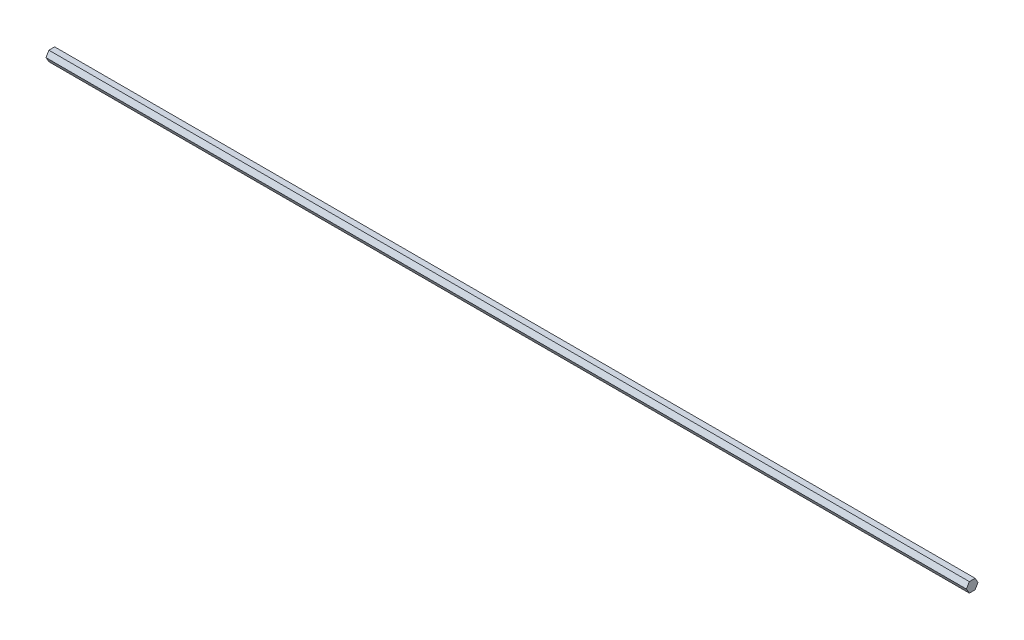
ISO-10303-21;
HEADER;
FILE_DESCRIPTION(('STEP AP214'),'2;1');
FILE_NAME('part.step','',(''),(''),'','','');
FILE_SCHEMA(('AUTOMOTIVE_DESIGN { 1 0 10303 214 1 1 1 1 }'));
ENDSEC;
DATA;
#1=APPLICATION_CONTEXT('core data for automotive mechanical design processes');
#2=APPLICATION_PROTOCOL_DEFINITION('international standard','automotive_design',2000,#1);
#3=PRODUCT_CONTEXT('',#1,'mechanical');
#4=PRODUCT('Part','Part','',(#3));
#5=PRODUCT_RELATED_PRODUCT_CATEGORY('part','',(#4));
#6=PRODUCT_DEFINITION_FORMATION('','',#4);
#7=PRODUCT_DEFINITION_CONTEXT('part definition',#1,'design');
#8=PRODUCT_DEFINITION('design','',#6,#7);
#9=PRODUCT_DEFINITION_SHAPE('','',#8);
#10=(LENGTH_UNIT() NAMED_UNIT(*) SI_UNIT(.MILLI.,.METRE.));
#11=(NAMED_UNIT(*) PLANE_ANGLE_UNIT() SI_UNIT($,.RADIAN.));
#12=(NAMED_UNIT(*) SI_UNIT($,.STERADIAN.) SOLID_ANGLE_UNIT());
#13=UNCERTAINTY_MEASURE_WITH_UNIT(LENGTH_MEASURE(1.E-05),#10,'distance_accuracy_value','');
#14=(GEOMETRIC_REPRESENTATION_CONTEXT(3) GLOBAL_UNCERTAINTY_ASSIGNED_CONTEXT((#13)) GLOBAL_UNIT_ASSIGNED_CONTEXT((#10,
#11,#12)) REPRESENTATION_CONTEXT('',''));
#15=CARTESIAN_POINT('',(0.,0.,0.));
#16=DIRECTION('',(0.,0.,1.));
#17=DIRECTION('',(1.,0.,0.));
#18=AXIS2_PLACEMENT_3D('',#15,#16,#17);
#19=CARTESIAN_POINT('',(119.38,-1.29903810567666,-0.75));
#20=DIRECTION('',(0.,0.5,0.866025403784439));
#21=DIRECTION('',(0.,-0.866025403784439,0.5));
#22=AXIS2_PLACEMENT_3D('',#19,#20,#21);
#23=PLANE('',#22);
#24=DIRECTION('',(0.,0.866025403784439,-0.5));
#25=VECTOR('',#24,1.);
#26=CARTESIAN_POINT('',(-119.38,-1.29903810567666,-0.75));
#27=LINE('',#26,#25);
#28=CARTESIAN_POINT('',(-119.38,-1.29903810567666,-0.75));
#29=VERTEX_POINT('',#28);
#30=CARTESIAN_POINT('',(-119.38,0.,-1.5));
#31=VERTEX_POINT('',#30);
#32=EDGE_CURVE('E116',#29,#31,#27,.T.);
#33=ORIENTED_EDGE('',*,*,#32,.T.);
#34=DIRECTION('',(-1.,0.,0.));
#35=VECTOR('',#34,1.);
#36=CARTESIAN_POINT('',(119.38,0.,-1.5));
#37=LINE('',#36,#35);
#38=CARTESIAN_POINT('',(119.38,0.,-1.5));
#39=VERTEX_POINT('',#38);
#40=EDGE_CURVE('E11',#39,#31,#37,.T.);
#41=ORIENTED_EDGE('',*,*,#40,.F.);
#42=DIRECTION('',(0.,0.866025403784439,-0.5));
#43=VECTOR('',#42,1.);
#44=CARTESIAN_POINT('',(119.38,-1.29903810567666,-0.75));
#45=LINE('',#44,#43);
#46=CARTESIAN_POINT('',(119.38,-1.29903810567666,-0.75));
#47=VERTEX_POINT('',#46);
#48=EDGE_CURVE('E126',#47,#39,#45,.T.);
#49=ORIENTED_EDGE('',*,*,#48,.F.);
#50=DIRECTION('',(-1.,0.,0.));
#51=VECTOR('',#50,1.);
#52=CARTESIAN_POINT('',(119.38,-1.29903810567666,-0.75));
#53=LINE('',#52,#51);
#54=EDGE_CURVE('E112',#47,#29,#53,.T.);
#55=ORIENTED_EDGE('',*,*,#54,.T.);
#56=EDGE_LOOP('',(#33,#41,#49,#55));
#57=FACE_BOUND('',#56,.T.);
#58=ADVANCED_FACE('F32',(#57),#23,.F.);
#59=CARTESIAN_POINT('',(119.38,0.,-1.5));
#60=DIRECTION('',(0.,-0.5,0.866025403784439));
#61=DIRECTION('',(0.,-0.866025403784439,-0.5));
#62=AXIS2_PLACEMENT_3D('',#59,#60,#61);
#63=PLANE('',#62);
#64=DIRECTION('',(0.,0.866025403784439,0.5));
#65=VECTOR('',#64,1.);
#66=CARTESIAN_POINT('',(-119.38,0.,-1.5));
#67=LINE('',#66,#65);
#68=CARTESIAN_POINT('',(-119.38,1.29903810567666,-0.75));
#69=VERTEX_POINT('',#68);
#70=EDGE_CURVE('E119',#31,#69,#67,.T.);
#71=ORIENTED_EDGE('',*,*,#70,.T.);
#72=DIRECTION('',(-1.,0.,0.));
#73=VECTOR('',#72,1.);
#74=CARTESIAN_POINT('',(119.38,1.29903810567666,-0.75));
#75=LINE('',#74,#73);
#76=CARTESIAN_POINT('',(119.38,1.29903810567666,-0.75));
#77=VERTEX_POINT('',#76);
#78=EDGE_CURVE('E40',#77,#69,#75,.T.);
#79=ORIENTED_EDGE('',*,*,#78,.F.);
#80=DIRECTION('',(0.,0.866025403784439,0.5));
#81=VECTOR('',#80,1.);
#82=CARTESIAN_POINT('',(119.38,0.,-1.5));
#83=LINE('',#82,#81);
#84=EDGE_CURVE('E85',#39,#77,#83,.T.);
#85=ORIENTED_EDGE('',*,*,#84,.F.);
#86=ORIENTED_EDGE('',*,*,#40,.T.);
#87=EDGE_LOOP('',(#71,#79,#85,#86));
#88=FACE_BOUND('',#87,.T.);
#89=ADVANCED_FACE('F150',(#88),#63,.F.);
#90=CARTESIAN_POINT('',(119.38,1.29903810567666,-0.75));
#91=DIRECTION('',(0.,-1.,0.));
#92=DIRECTION('',(0.,0.,-1.));
#93=AXIS2_PLACEMENT_3D('',#90,#91,#92);
#94=PLANE('',#93);
#95=DIRECTION('',(0.,0.,1.));
#96=VECTOR('',#95,1.);
#97=CARTESIAN_POINT('',(-119.38,1.29903810567666,-0.75));
#98=LINE('',#97,#96);
#99=CARTESIAN_POINT('',(-119.38,1.29903810567666,0.75));
#100=VERTEX_POINT('',#99);
#101=EDGE_CURVE('E121',#69,#100,#98,.T.);
#102=ORIENTED_EDGE('',*,*,#101,.T.);
#103=DIRECTION('',(-1.,0.,0.));
#104=VECTOR('',#103,1.);
#105=CARTESIAN_POINT('',(119.38,1.29903810567666,0.75));
#106=LINE('',#105,#104);
#107=CARTESIAN_POINT('',(119.38,1.29903810567666,0.75));
#108=VERTEX_POINT('',#107);
#109=EDGE_CURVE('E107',#108,#100,#106,.T.);
#110=ORIENTED_EDGE('',*,*,#109,.F.);
#111=DIRECTION('',(0.,0.,1.));
#112=VECTOR('',#111,1.);
#113=CARTESIAN_POINT('',(119.38,1.29903810567666,-0.75));
#114=LINE('',#113,#112);
#115=EDGE_CURVE('E98',#77,#108,#114,.T.);
#116=ORIENTED_EDGE('',*,*,#115,.F.);
#117=ORIENTED_EDGE('',*,*,#78,.T.);
#118=EDGE_LOOP('',(#102,#110,#116,#117));
#119=FACE_BOUND('',#118,.T.);
#120=ADVANCED_FACE('F132',(#119),#94,.F.);
#121=CARTESIAN_POINT('',(119.38,1.29903810567666,0.75));
#122=DIRECTION('',(0.,-0.5,-0.866025403784439));
#123=DIRECTION('',(0.,0.866025403784439,-0.5));
#124=AXIS2_PLACEMENT_3D('',#121,#122,#123);
#125=PLANE('',#124);
#126=DIRECTION('',(0.,-0.866025403784439,0.5));
#127=VECTOR('',#126,1.);
#128=CARTESIAN_POINT('',(-119.38,1.29903810567666,0.75));
#129=LINE('',#128,#127);
#130=CARTESIAN_POINT('',(-119.38,0.,1.5));
#131=VERTEX_POINT('',#130);
#132=EDGE_CURVE('E106',#100,#131,#129,.T.);
#133=ORIENTED_EDGE('',*,*,#132,.T.);
#134=DIRECTION('',(-1.,0.,0.));
#135=VECTOR('',#134,1.);
#136=CARTESIAN_POINT('',(119.38,0.,1.5));
#137=LINE('',#136,#135);
#138=CARTESIAN_POINT('',(119.38,0.,1.5));
#139=VERTEX_POINT('',#138);
#140=EDGE_CURVE('E103',#139,#131,#137,.T.);
#141=ORIENTED_EDGE('',*,*,#140,.F.);
#142=DIRECTION('',(0.,-0.866025403784439,0.5));
#143=VECTOR('',#142,1.);
#144=CARTESIAN_POINT('',(119.38,1.29903810567666,0.75));
#145=LINE('',#144,#143);
#146=EDGE_CURVE('E92',#108,#139,#145,.T.);
#147=ORIENTED_EDGE('',*,*,#146,.F.);
#148=ORIENTED_EDGE('',*,*,#109,.T.);
#149=EDGE_LOOP('',(#133,#141,#147,#148));
#150=FACE_BOUND('',#149,.T.);
#151=ADVANCED_FACE('F104',(#150),#125,.F.);
#152=CARTESIAN_POINT('',(119.38,0.,1.5));
#153=DIRECTION('',(0.,0.5,-0.866025403784438));
#154=DIRECTION('',(0.,0.866025403784438,0.5));
#155=AXIS2_PLACEMENT_3D('',#152,#153,#154);
#156=PLANE('',#155);
#157=DIRECTION('',(0.,-0.866025403784439,-0.5));
#158=VECTOR('',#157,1.);
#159=CARTESIAN_POINT('',(-119.38,0.,1.5));
#160=LINE('',#159,#158);
#161=CARTESIAN_POINT('',(-119.38,-1.29903810567666,0.75));
#162=VERTEX_POINT('',#161);
#163=EDGE_CURVE('E71',#131,#162,#160,.T.);
#164=ORIENTED_EDGE('',*,*,#163,.T.);
#165=DIRECTION('',(-1.,0.,0.));
#166=VECTOR('',#165,1.);
#167=CARTESIAN_POINT('',(119.38,-1.29903810567666,0.75));
#168=LINE('',#167,#166);
#169=CARTESIAN_POINT('',(119.38,-1.29903810567666,0.75));
#170=VERTEX_POINT('',#169);
#171=EDGE_CURVE('E108',#170,#162,#168,.T.);
#172=ORIENTED_EDGE('',*,*,#171,.F.);
#173=DIRECTION('',(0.,-0.866025403784439,-0.5));
#174=VECTOR('',#173,1.);
#175=CARTESIAN_POINT('',(119.38,0.,1.5));
#176=LINE('',#175,#174);
#177=EDGE_CURVE('E96',#139,#170,#176,.T.);
#178=ORIENTED_EDGE('',*,*,#177,.F.);
#179=ORIENTED_EDGE('',*,*,#140,.T.);
#180=EDGE_LOOP('',(#164,#172,#178,#179));
#181=FACE_BOUND('',#180,.T.);
#182=ADVANCED_FACE('F110',(#181),#156,.F.);
#183=CARTESIAN_POINT('',(119.38,-1.29903810567666,0.75));
#184=DIRECTION('',(0.,1.,0.));
#185=DIRECTION('',(0.,0.,1.));
#186=AXIS2_PLACEMENT_3D('',#183,#184,#185);
#187=PLANE('',#186);
#188=DIRECTION('',(0.,0.,-1.));
#189=VECTOR('',#188,1.);
#190=CARTESIAN_POINT('',(-119.38,-1.29903810567666,0.75));
#191=LINE('',#190,#189);
#192=EDGE_CURVE('E77',#162,#29,#191,.T.);
#193=ORIENTED_EDGE('',*,*,#192,.T.);
#194=ORIENTED_EDGE('',*,*,#54,.F.);
#195=DIRECTION('',(0.,0.,-1.));
#196=VECTOR('',#195,1.);
#197=CARTESIAN_POINT('',(119.38,-1.29903810567666,0.75));
#198=LINE('',#197,#196);
#199=EDGE_CURVE('E48',#170,#47,#198,.T.);
#200=ORIENTED_EDGE('',*,*,#199,.F.);
#201=ORIENTED_EDGE('',*,*,#171,.T.);
#202=EDGE_LOOP('',(#193,#194,#200,#201));
#203=FACE_BOUND('',#202,.T.);
#204=ADVANCED_FACE('F139',(#203),#187,.F.);
#205=CARTESIAN_POINT('',(119.38,0.,0.));
#206=DIRECTION('',(1.,0.,0.));
#207=DIRECTION('',(0.,0.,-1.));
#208=AXIS2_PLACEMENT_3D('',#205,#206,#207);
#209=PLANE('',#208);
#210=ORIENTED_EDGE('',*,*,#48,.T.);
#211=ORIENTED_EDGE('',*,*,#84,.T.);
#212=ORIENTED_EDGE('',*,*,#115,.T.);
#213=ORIENTED_EDGE('',*,*,#146,.T.);
#214=ORIENTED_EDGE('',*,*,#177,.T.);
#215=ORIENTED_EDGE('',*,*,#199,.T.);
#216=EDGE_LOOP('',(#210,#211,#212,#213,#214,#215));
#217=FACE_BOUND('',#216,.T.);
#218=ADVANCED_FACE('F94',(#217),#209,.T.);
#219=CARTESIAN_POINT('',(-119.38,0.,0.));
#220=DIRECTION('',(1.,0.,0.));
#221=DIRECTION('',(0.,0.,-1.));
#222=AXIS2_PLACEMENT_3D('',#219,#220,#221);
#223=PLANE('',#222);
#224=ORIENTED_EDGE('',*,*,#32,.F.);
#225=ORIENTED_EDGE('',*,*,#192,.F.);
#226=ORIENTED_EDGE('',*,*,#163,.F.);
#227=ORIENTED_EDGE('',*,*,#132,.F.);
#228=ORIENTED_EDGE('',*,*,#101,.F.);
#229=ORIENTED_EDGE('',*,*,#70,.F.);
#230=EDGE_LOOP('',(#224,#225,#226,#227,#228,#229));
#231=FACE_BOUND('',#230,.T.);
#232=ADVANCED_FACE('F135',(#231),#223,.F.);
#233=CLOSED_SHELL('',(#58,#89,#120,#151,#182,#204,#218,#232));
#234=MANIFOLD_SOLID_BREP('B2',#233);
#235=ADVANCED_BREP_SHAPE_REPRESENTATION('',(#18,#234),#14);
#236=SHAPE_DEFINITION_REPRESENTATION(#9,#235);
ENDSEC;
END-ISO-10303-21;
